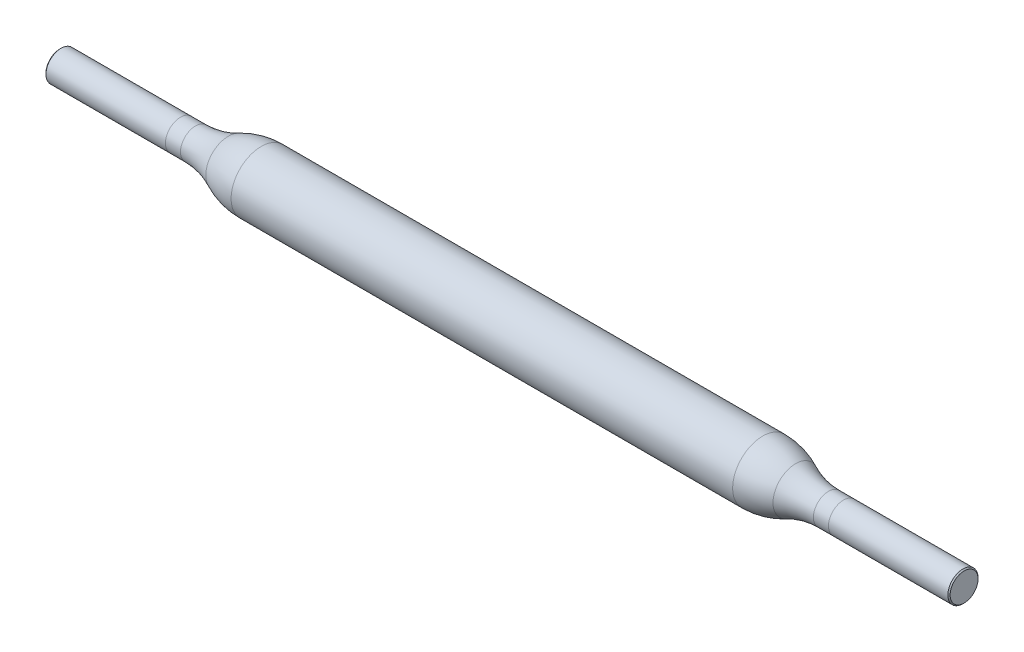
ISO-10303-21;
HEADER;
FILE_DESCRIPTION(('STEP AP214'),'2;1');
FILE_NAME('part.step','',(''),(''),'','','');
FILE_SCHEMA(('AUTOMOTIVE_DESIGN { 1 0 10303 214 1 1 1 1 }'));
ENDSEC;
DATA;
#1=APPLICATION_CONTEXT('core data for automotive mechanical design processes');
#2=APPLICATION_PROTOCOL_DEFINITION('international standard','automotive_design',2000,#1);
#3=PRODUCT_CONTEXT('',#1,'mechanical');
#4=PRODUCT('Part','Part','',(#3));
#5=PRODUCT_RELATED_PRODUCT_CATEGORY('part','',(#4));
#6=PRODUCT_DEFINITION_FORMATION('','',#4);
#7=PRODUCT_DEFINITION_CONTEXT('part definition',#1,'design');
#8=PRODUCT_DEFINITION('design','',#6,#7);
#9=PRODUCT_DEFINITION_SHAPE('','',#8);
#10=(LENGTH_UNIT() NAMED_UNIT(*) SI_UNIT(.MILLI.,.METRE.));
#11=(NAMED_UNIT(*) PLANE_ANGLE_UNIT() SI_UNIT($,.RADIAN.));
#12=(NAMED_UNIT(*) SI_UNIT($,.STERADIAN.) SOLID_ANGLE_UNIT());
#13=UNCERTAINTY_MEASURE_WITH_UNIT(LENGTH_MEASURE(1.E-05),#10,'distance_accuracy_value','');
#14=(GEOMETRIC_REPRESENTATION_CONTEXT(3) GLOBAL_UNCERTAINTY_ASSIGNED_CONTEXT((#13)) GLOBAL_UNIT_ASSIGNED_CONTEXT((#10,
#11,#12)) REPRESENTATION_CONTEXT('',''));
#15=CARTESIAN_POINT('',(0.,0.,0.));
#16=DIRECTION('',(0.,0.,1.));
#17=DIRECTION('',(1.,0.,0.));
#18=AXIS2_PLACEMENT_3D('',#15,#16,#17);
#19=CARTESIAN_POINT('',(-30.,0.,0.));
#20=DIRECTION('',(-1.,0.,0.));
#21=DIRECTION('',(0.,0.,1.));
#22=AXIS2_PLACEMENT_3D('',#19,#20,#21);
#23=CYLINDRICAL_SURFACE('',#22,0.999999999999999);
#24=CARTESIAN_POINT('',(21.,0.,0.));
#25=DIRECTION('',(-1.,0.,0.));
#26=DIRECTION('',(0.,0.,1.));
#27=AXIS2_PLACEMENT_3D('',#24,#25,#26);
#28=CIRCLE('',#27,0.999999999999999);
#29=CARTESIAN_POINT('',(21.,0.,0.999999999999999));
#30=VERTEX_POINT('',#29);
#31=EDGE_CURVE('E60',#30,#30,#28,.T.);
#32=ORIENTED_EDGE('',*,*,#31,.F.);
#33=EDGE_LOOP('',(#32));
#34=FACE_BOUND('',#33,.T.);
#35=CARTESIAN_POINT('',(22.,0.,0.));
#36=DIRECTION('',(1.,0.,0.));
#37=DIRECTION('',(0.,0.,-1.));
#38=AXIS2_PLACEMENT_3D('',#35,#36,#37);
#39=CIRCLE('',#38,0.999999999999999);
#40=CARTESIAN_POINT('',(22.,0.,-0.999999999999999));
#41=VERTEX_POINT('',#40);
#42=EDGE_CURVE('E52',#41,#41,#39,.T.);
#43=ORIENTED_EDGE('',*,*,#42,.F.);
#44=EDGE_LOOP('',(#43));
#45=FACE_BOUND('',#44,.T.);
#46=ADVANCED_FACE('F32',(#34,#45),#23,.T.);
#47=CARTESIAN_POINT('',(-30.,0.,0.));
#48=DIRECTION('',(-1.,0.,0.));
#49=DIRECTION('',(0.,0.,1.));
#50=AXIS2_PLACEMENT_3D('',#47,#48,#49);
#51=CYLINDRICAL_SURFACE('',#50,1.);
#52=CARTESIAN_POINT('',(-29.925,0.,0.));
#53=DIRECTION('',(1.,0.,0.));
#54=DIRECTION('',(0.,0.,-1.));
#55=AXIS2_PLACEMENT_3D('',#52,#53,#54);
#56=CIRCLE('',#55,1.);
#57=CARTESIAN_POINT('',(-29.925,0.,-1.));
#58=VERTEX_POINT('',#57);
#59=EDGE_CURVE('E43',#58,#58,#56,.T.);
#60=ORIENTED_EDGE('',*,*,#59,.T.);
#61=EDGE_LOOP('',(#60));
#62=FACE_BOUND('',#61,.T.);
#63=CARTESIAN_POINT('',(-22.,0.,0.));
#64=DIRECTION('',(1.,0.,0.));
#65=DIRECTION('',(0.,0.,-1.));
#66=AXIS2_PLACEMENT_3D('',#63,#64,#65);
#67=CIRCLE('',#66,1.);
#68=CARTESIAN_POINT('',(-22.,0.,-1.));
#69=VERTEX_POINT('',#68);
#70=EDGE_CURVE('E56',#69,#69,#67,.T.);
#71=ORIENTED_EDGE('',*,*,#70,.F.);
#72=EDGE_LOOP('',(#71));
#73=FACE_BOUND('',#72,.T.);
#74=ADVANCED_FACE('F115',(#62,#73),#51,.T.);
#75=ORIENTED_EDGE('',*,*,#70,.T.);
#76=EDGE_LOOP('',(#75));
#77=FACE_BOUND('',#76,.T.);
#78=CARTESIAN_POINT('',(-21.,0.,0.));
#79=DIRECTION('',(-1.,0.,0.));
#80=DIRECTION('',(0.,0.,1.));
#81=AXIS2_PLACEMENT_3D('',#78,#79,#80);
#82=CIRCLE('',#81,1.);
#83=CARTESIAN_POINT('',(-21.,0.,1.));
#84=VERTEX_POINT('',#83);
#85=EDGE_CURVE('E75',#84,#84,#82,.T.);
#86=ORIENTED_EDGE('',*,*,#85,.T.);
#87=EDGE_LOOP('',(#86));
#88=FACE_BOUND('',#87,.T.);
#89=ADVANCED_FACE('F79',(#77,#88),#51,.T.);
#90=CARTESIAN_POINT('',(-30.,0.,0.));
#91=DIRECTION('',(1.,0.,0.));
#92=DIRECTION('',(0.,0.,-1.));
#93=AXIS2_PLACEMENT_3D('',#90,#91,#92);
#94=PLANE('',#93);
#95=CARTESIAN_POINT('',(-30.,0.,0.));
#96=DIRECTION('',(1.,0.,0.));
#97=DIRECTION('',(0.,0.,-1.));
#98=AXIS2_PLACEMENT_3D('',#95,#96,#97);
#99=CIRCLE('',#98,0.924999999999995);
#100=CARTESIAN_POINT('',(-30.,0.,-0.924999999999995));
#101=VERTEX_POINT('',#100);
#102=EDGE_CURVE('E47',#101,#101,#99,.F.);
#103=ORIENTED_EDGE('',*,*,#102,.T.);
#104=EDGE_LOOP('',(#103));
#105=FACE_BOUND('',#104,.T.);
#106=ADVANCED_FACE('F124',(#105),#94,.F.);
#107=CARTESIAN_POINT('',(30.,0.,0.));
#108=DIRECTION('',(-1.,0.,0.));
#109=DIRECTION('',(0.,0.,1.));
#110=AXIS2_PLACEMENT_3D('',#107,#108,#109);
#111=PLANE('',#110);
#112=CARTESIAN_POINT('',(30.,0.,0.));
#113=DIRECTION('',(-1.,0.,0.));
#114=DIRECTION('',(0.,0.,1.));
#115=AXIS2_PLACEMENT_3D('',#112,#113,#114);
#116=CIRCLE('',#115,0.925000000000002);
#117=CARTESIAN_POINT('',(30.,0.,0.925000000000002));
#118=VERTEX_POINT('',#117);
#119=EDGE_CURVE('E10',#118,#118,#116,.F.);
#120=ORIENTED_EDGE('',*,*,#119,.T.);
#121=EDGE_LOOP('',(#120));
#122=FACE_BOUND('',#121,.T.);
#123=ADVANCED_FACE('F120',(#122),#111,.F.);
#124=CARTESIAN_POINT('',(29.925,0.,0.));
#125=DIRECTION('',(-1.,0.,0.));
#126=DIRECTION('',(0.,0.,1.));
#127=AXIS2_PLACEMENT_3D('',#124,#125,#126);
#128=CIRCLE('',#127,0.999999999999999);
#129=CARTESIAN_POINT('',(29.925,0.,0.999999999999999));
#130=VERTEX_POINT('',#129);
#131=EDGE_CURVE('E39',#130,#130,#128,.T.);
#132=ORIENTED_EDGE('',*,*,#131,.T.);
#133=EDGE_LOOP('',(#132));
#134=FACE_BOUND('',#133,.T.);
#135=ORIENTED_EDGE('',*,*,#42,.T.);
#136=EDGE_LOOP('',(#135));
#137=FACE_BOUND('',#136,.T.);
#138=ADVANCED_FACE('F109',(#134,#137),#23,.T.);
#139=CARTESIAN_POINT('',(21.,0.,0.));
#140=DIRECTION('',(-1.,0.,0.));
#141=DIRECTION('',(0.,0.,1.));
#142=AXIS2_PLACEMENT_3D('',#139,#140,#141);
#143=TOROIDAL_SURFACE('',#142,6.,5.);
#144=CARTESIAN_POINT('',(18.8205505282297,0.,0.));
#145=DIRECTION('',(-1.,0.,0.));
#146=DIRECTION('',(0.,0.,1.));
#147=AXIS2_PLACEMENT_3D('',#144,#145,#146);
#148=CIRCLE('',#147,1.5);
#149=CARTESIAN_POINT('',(18.8205505282297,0.,1.5));
#150=VERTEX_POINT('',#149);
#151=EDGE_CURVE('E63',#150,#150,#148,.T.);
#152=ORIENTED_EDGE('',*,*,#151,.F.);
#153=EDGE_LOOP('',(#152));
#154=FACE_BOUND('',#153,.T.);
#155=ORIENTED_EDGE('',*,*,#31,.T.);
#156=EDGE_LOOP('',(#155));
#157=FACE_BOUND('',#156,.T.);
#158=ADVANCED_FACE('F103',(#154,#157),#143,.F.);
#159=CARTESIAN_POINT('',(16.6411010564593,0.,0.));
#160=DIRECTION('',(-1.,0.,0.));
#161=DIRECTION('',(0.,0.,1.));
#162=AXIS2_PLACEMENT_3D('',#159,#160,#161);
#163=DEGENERATE_TOROIDAL_SURFACE('',#162,3.,5.,.F.);
#164=CARTESIAN_POINT('',(16.6411010564593,0.,0.));
#165=DIRECTION('',(-1.,0.,0.));
#166=DIRECTION('',(0.,0.,1.));
#167=AXIS2_PLACEMENT_3D('',#164,#165,#166);
#168=CIRCLE('',#167,2.);
#169=CARTESIAN_POINT('',(16.6411010564593,0.,2.));
#170=VERTEX_POINT('',#169);
#171=EDGE_CURVE('E66',#170,#170,#168,.T.);
#172=ORIENTED_EDGE('',*,*,#171,.F.);
#173=EDGE_LOOP('',(#172));
#174=FACE_BOUND('',#173,.T.);
#175=ORIENTED_EDGE('',*,*,#151,.T.);
#176=EDGE_LOOP('',(#175));
#177=FACE_BOUND('',#176,.T.);
#178=ADVANCED_FACE('F97',(#174,#177),#163,.F.);
#179=CARTESIAN_POINT('',(-30.,0.,0.));
#180=DIRECTION('',(-1.,0.,0.));
#181=DIRECTION('',(0.,0.,1.));
#182=AXIS2_PLACEMENT_3D('',#179,#180,#181);
#183=CYLINDRICAL_SURFACE('',#182,2.);
#184=CARTESIAN_POINT('',(-16.6411010564593,0.,0.));
#185=DIRECTION('',(-1.,0.,0.));
#186=DIRECTION('',(0.,0.,1.));
#187=AXIS2_PLACEMENT_3D('',#184,#185,#186);
#188=CIRCLE('',#187,2.);
#189=CARTESIAN_POINT('',(-16.6411010564593,0.,2.));
#190=VERTEX_POINT('',#189);
#191=EDGE_CURVE('E69',#190,#190,#188,.T.);
#192=ORIENTED_EDGE('',*,*,#191,.F.);
#193=EDGE_LOOP('',(#192));
#194=FACE_BOUND('',#193,.T.);
#195=ORIENTED_EDGE('',*,*,#171,.T.);
#196=EDGE_LOOP('',(#195));
#197=FACE_BOUND('',#196,.T.);
#198=ADVANCED_FACE('F91',(#194,#197),#183,.T.);
#199=CARTESIAN_POINT('',(-16.6411010564593,0.,0.));
#200=DIRECTION('',(-1.,0.,0.));
#201=DIRECTION('',(0.,0.,1.));
#202=AXIS2_PLACEMENT_3D('',#199,#200,#201);
#203=DEGENERATE_TOROIDAL_SURFACE('',#202,3.,5.,.F.);
#204=CARTESIAN_POINT('',(-18.8205505282297,0.,0.));
#205=DIRECTION('',(-1.,0.,0.));
#206=DIRECTION('',(0.,0.,1.));
#207=AXIS2_PLACEMENT_3D('',#204,#205,#206);
#208=CIRCLE('',#207,1.5);
#209=CARTESIAN_POINT('',(-18.8205505282297,0.,1.5));
#210=VERTEX_POINT('',#209);
#211=EDGE_CURVE('E72',#210,#210,#208,.T.);
#212=ORIENTED_EDGE('',*,*,#211,.F.);
#213=EDGE_LOOP('',(#212));
#214=FACE_BOUND('',#213,.T.);
#215=ORIENTED_EDGE('',*,*,#191,.T.);
#216=EDGE_LOOP('',(#215));
#217=FACE_BOUND('',#216,.T.);
#218=ADVANCED_FACE('F85',(#214,#217),#203,.F.);
#219=CARTESIAN_POINT('',(-21.,0.,0.));
#220=DIRECTION('',(-1.,0.,0.));
#221=DIRECTION('',(0.,0.,1.));
#222=AXIS2_PLACEMENT_3D('',#219,#220,#221);
#223=TOROIDAL_SURFACE('',#222,6.,5.);
#224=ORIENTED_EDGE('',*,*,#85,.F.);
#225=EDGE_LOOP('',(#224));
#226=FACE_BOUND('',#225,.T.);
#227=ORIENTED_EDGE('',*,*,#211,.T.);
#228=EDGE_LOOP('',(#227));
#229=FACE_BOUND('',#228,.T.);
#230=ADVANCED_FACE('F81',(#226,#229),#223,.F.);
#231=CARTESIAN_POINT('',(-30.,0.,0.));
#232=DIRECTION('',(1.,0.,0.));
#233=DIRECTION('',(0.,0.,-1.));
#234=AXIS2_PLACEMENT_3D('',#231,#232,#233);
#235=CONICAL_SURFACE('',#234,0.924999999999995,0.785398163397489);
#236=ORIENTED_EDGE('',*,*,#59,.F.);
#237=EDGE_LOOP('',(#236));
#238=FACE_BOUND('',#237,.T.);
#239=ORIENTED_EDGE('',*,*,#102,.F.);
#240=EDGE_LOOP('',(#239));
#241=FACE_BOUND('',#240,.T.);
#242=ADVANCED_FACE('F84',(#238,#241),#235,.T.);
#243=CARTESIAN_POINT('',(29.925,0.,0.));
#244=DIRECTION('',(-1.,0.,0.));
#245=DIRECTION('',(0.,0.,1.));
#246=AXIS2_PLACEMENT_3D('',#243,#244,#245);
#247=CONICAL_SURFACE('',#246,0.999999999999999,0.785398163397483);
#248=ORIENTED_EDGE('',*,*,#119,.F.);
#249=EDGE_LOOP('',(#248));
#250=FACE_BOUND('',#249,.T.);
#251=ORIENTED_EDGE('',*,*,#131,.F.);
#252=EDGE_LOOP('',(#251));
#253=FACE_BOUND('',#252,.T.);
#254=ADVANCED_FACE('F34',(#250,#253),#247,.T.);
#255=CLOSED_SHELL('',(#46,#74,#89,#106,#123,#138,#158,#178,#198,#218,#230,#242,#254));
#256=MANIFOLD_SOLID_BREP('B2',#255);
#257=ADVANCED_BREP_SHAPE_REPRESENTATION('',(#18,#256),#14);
#258=SHAPE_DEFINITION_REPRESENTATION(#9,#257);
ENDSEC;
END-ISO-10303-21;
